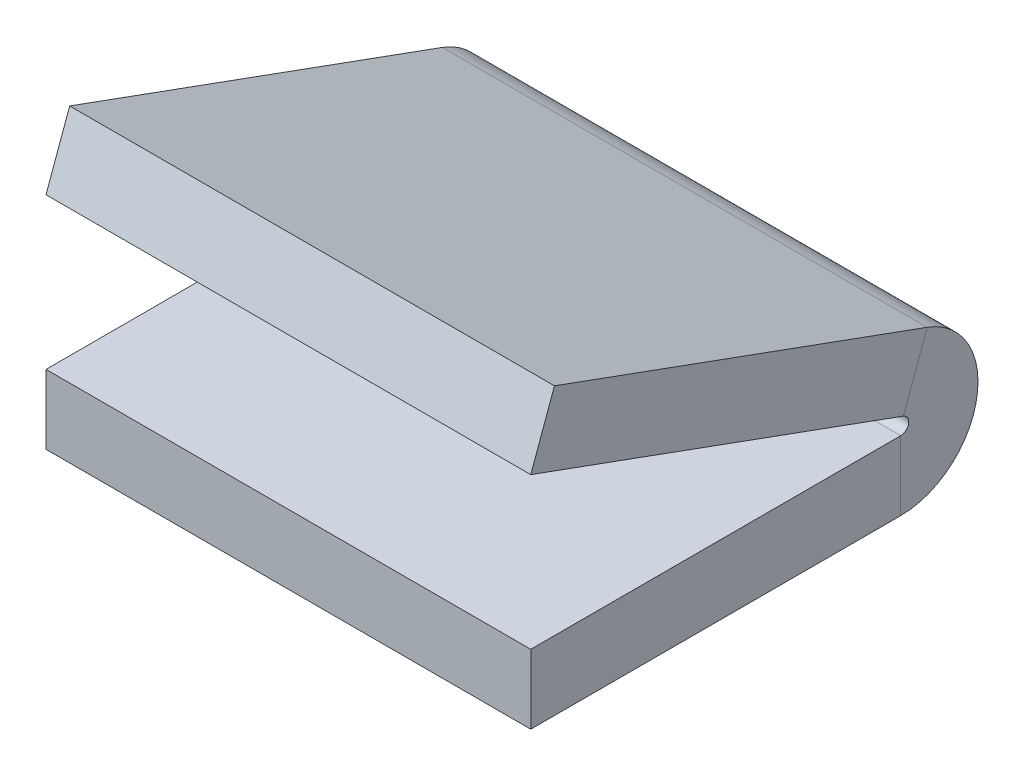
ISO-10303-21;
HEADER;
FILE_DESCRIPTION(('STEP AP214'),'2;1');
FILE_NAME('part.step','',(''),(''),'','','');
FILE_SCHEMA(('AUTOMOTIVE_DESIGN { 1 0 10303 214 1 1 1 1 }'));
ENDSEC;
DATA;
#1=APPLICATION_CONTEXT('core data for automotive mechanical design processes');
#2=APPLICATION_PROTOCOL_DEFINITION('international standard','automotive_design',2000,#1);
#3=PRODUCT_CONTEXT('',#1,'mechanical');
#4=PRODUCT('Part','Part','',(#3));
#5=PRODUCT_RELATED_PRODUCT_CATEGORY('part','',(#4));
#6=PRODUCT_DEFINITION_FORMATION('','',#4);
#7=PRODUCT_DEFINITION_CONTEXT('part definition',#1,'design');
#8=PRODUCT_DEFINITION('design','',#6,#7);
#9=PRODUCT_DEFINITION_SHAPE('','',#8);
#10=(LENGTH_UNIT() NAMED_UNIT(*) SI_UNIT(.MILLI.,.METRE.));
#11=(NAMED_UNIT(*) PLANE_ANGLE_UNIT() SI_UNIT($,.RADIAN.));
#12=(NAMED_UNIT(*) SI_UNIT($,.STERADIAN.) SOLID_ANGLE_UNIT());
#13=UNCERTAINTY_MEASURE_WITH_UNIT(LENGTH_MEASURE(1.E-05),#10,'distance_accuracy_value','');
#14=(GEOMETRIC_REPRESENTATION_CONTEXT(3) GLOBAL_UNCERTAINTY_ASSIGNED_CONTEXT((#13)) GLOBAL_UNIT_ASSIGNED_CONTEXT((#10,
#11,#12)) REPRESENTATION_CONTEXT('',''));
#15=CARTESIAN_POINT('',(0.,0.,0.));
#16=DIRECTION('',(0.,0.,1.));
#17=DIRECTION('',(1.,0.,0.));
#18=AXIS2_PLACEMENT_3D('',#15,#16,#17);
#19=CARTESIAN_POINT('',(44.45,1.42877758447095,-34.1744658492431));
#20=DIRECTION('',(1.,0.,0.));
#21=DIRECTION('',(0.,0.,-1.));
#22=AXIS2_PLACEMENT_3D('',#19,#20,#21);
#23=PLANE('',#22);
#24=DIRECTION('',(0.,0.93969262078591,-0.342020143325663));
#25=VECTOR('',#24,1.);
#26=CARTESIAN_POINT('',(44.45,1.42877758447095,-34.1744658492431));
#27=LINE('',#26,#25);
#28=CARTESIAN_POINT('',(44.45,1.42877758447095,-34.1744658492431));
#29=VERTEX_POINT('',#28);
#30=CARTESIAN_POINT('',(44.45,7.39582572646148,-36.346293759361));
#31=VERTEX_POINT('',#30);
#32=EDGE_CURVE('E11',#29,#31,#27,.T.);
#33=ORIENTED_EDGE('',*,*,#32,.F.);
#34=CARTESIAN_POINT('',(44.45,0.736600000000024,-33.9225338116694));
#35=DIRECTION('',(-1.,0.,0.));
#36=DIRECTION('',(0.,0.,1.));
#37=AXIS2_PLACEMENT_3D('',#34,#35,#36);
#38=CIRCLE('',#37,0.7366);
#39=CARTESIAN_POINT('',(44.45,0.,-33.9225338116694));
#40=VERTEX_POINT('',#39);
#41=EDGE_CURVE('E134',#40,#29,#38,.F.);
#42=ORIENTED_EDGE('',*,*,#41,.F.);
#43=DIRECTION('',(0.,1.,0.));
#44=VECTOR('',#43,1.);
#45=CARTESIAN_POINT('',(44.45,-6.34999999999998,-33.9225338116691));
#46=LINE('',#45,#44);
#47=CARTESIAN_POINT('',(44.45,-6.34999999999998,-33.9225338116691));
#48=VERTEX_POINT('',#47);
#49=EDGE_CURVE('E45',#48,#40,#46,.T.);
#50=ORIENTED_EDGE('',*,*,#49,.F.);
#51=CARTESIAN_POINT('',(44.45,0.736600000000024,-33.9225338116694));
#52=DIRECTION('',(1.,0.,0.));
#53=DIRECTION('',(0.,0.,-1.));
#54=AXIS2_PLACEMENT_3D('',#51,#52,#53);
#55=CIRCLE('',#54,7.0866);
#56=EDGE_CURVE('E127',#48,#31,#55,.T.);
#57=ORIENTED_EDGE('',*,*,#56,.T.);
#58=EDGE_LOOP('',(#33,#42,#50,#57));
#59=FACE_BOUND('',#58,.T.);
#60=ADVANCED_FACE('F37',(#59),#23,.T.);
#61=CARTESIAN_POINT('',(44.45,-6.34999999999998,-33.9225338116691));
#62=DIRECTION('',(1.,0.,0.));
#63=DIRECTION('',(0.,0.,-1.));
#64=AXIS2_PLACEMENT_3D('',#61,#62,#63);
#65=PLANE('',#64);
#66=DIRECTION('',(0.,0.342020143325663,0.939692620785911));
#67=VECTOR('',#66,1.);
#68=CARTESIAN_POINT('',(44.45,0.,-38.1));
#69=LINE('',#68,#67);
#70=CARTESIAN_POINT('',(44.45,13.867265925542,0.));
#71=VERTEX_POINT('',#70);
#72=EDGE_CURVE('E183',#29,#71,#69,.T.);
#73=ORIENTED_EDGE('',*,*,#72,.F.);
#74=ORIENTED_EDGE('',*,*,#32,.T.);
#75=DIRECTION('',(0.,0.342020143325663,0.939692620785911));
#76=VECTOR('',#75,1.);
#77=CARTESIAN_POINT('',(44.45,5.96704814199053,-40.271827910118));
#78=LINE('',#77,#76);
#79=CARTESIAN_POINT('',(44.45,19.8343140675326,-2.17182791011795));
#80=VERTEX_POINT('',#79);
#81=EDGE_CURVE('E93',#31,#80,#78,.T.);
#82=ORIENTED_EDGE('',*,*,#81,.T.);
#83=DIRECTION('',(0.,0.939692620785911,-0.342020143325661));
#84=VECTOR('',#83,1.);
#85=CARTESIAN_POINT('',(44.45,13.867265925542,0.));
#86=LINE('',#85,#84);
#87=EDGE_CURVE('E340',#71,#80,#86,.T.);
#88=ORIENTED_EDGE('',*,*,#87,.F.);
#89=EDGE_LOOP('',(#73,#74,#82,#88));
#90=FACE_BOUND('',#89,.T.);
#91=ADVANCED_FACE('F191',(#90),#65,.T.);
#92=CARTESIAN_POINT('',(0.,0.,-33.9225338116694));
#93=DIRECTION('',(-1.,0.,0.));
#94=DIRECTION('',(0.,0.,1.));
#95=AXIS2_PLACEMENT_3D('',#92,#93,#94);
#96=PLANE('',#95);
#97=DIRECTION('',(0.,-1.,0.));
#98=VECTOR('',#97,1.);
#99=CARTESIAN_POINT('',(0.,0.,-33.9225338116694));
#100=LINE('',#99,#98);
#101=CARTESIAN_POINT('',(0.,0.,-33.9225338116694));
#102=VERTEX_POINT('',#101);
#103=CARTESIAN_POINT('',(0.,-6.34999999999998,-33.9225338116691));
#104=VERTEX_POINT('',#103);
#105=EDGE_CURVE('E80',#102,#104,#100,.T.);
#106=ORIENTED_EDGE('',*,*,#105,.F.);
#107=CARTESIAN_POINT('',(0.,0.736600000000024,-33.9225338116694));
#108=DIRECTION('',(-1.,0.,0.));
#109=DIRECTION('',(0.,0.,1.));
#110=AXIS2_PLACEMENT_3D('',#107,#108,#109);
#111=CIRCLE('',#110,0.7366);
#112=CARTESIAN_POINT('',(0.,1.42877758447095,-34.1744658492431));
#113=VERTEX_POINT('',#112);
#114=EDGE_CURVE('E149',#102,#113,#111,.F.);
#115=ORIENTED_EDGE('',*,*,#114,.T.);
#116=DIRECTION('',(0.,-0.93969262078591,0.342020143325663));
#117=VECTOR('',#116,1.);
#118=CARTESIAN_POINT('',(0.,7.39582572646148,-36.346293759361));
#119=LINE('',#118,#117);
#120=CARTESIAN_POINT('',(0.,7.39582572646148,-36.346293759361));
#121=VERTEX_POINT('',#120);
#122=EDGE_CURVE('E87',#121,#113,#119,.T.);
#123=ORIENTED_EDGE('',*,*,#122,.F.);
#124=CARTESIAN_POINT('',(0.,0.736600000000024,-33.9225338116694));
#125=DIRECTION('',(1.,0.,0.));
#126=DIRECTION('',(0.,0.,-1.));
#127=AXIS2_PLACEMENT_3D('',#124,#125,#126);
#128=CIRCLE('',#127,7.0866);
#129=EDGE_CURVE('E156',#104,#121,#128,.T.);
#130=ORIENTED_EDGE('',*,*,#129,.F.);
#131=EDGE_LOOP('',(#106,#115,#123,#130));
#132=FACE_BOUND('',#131,.T.);
#133=ADVANCED_FACE('F189',(#132),#96,.T.);
#134=CARTESIAN_POINT('',(0.,7.39582572646148,-36.346293759361));
#135=DIRECTION('',(-1.,0.,0.));
#136=DIRECTION('',(0.,0.,1.));
#137=AXIS2_PLACEMENT_3D('',#134,#135,#136);
#138=PLANE('',#137);
#139=DIRECTION('',(0.,0.,-1.));
#140=VECTOR('',#139,1.);
#141=CARTESIAN_POINT('',(0.,0.,0.));
#142=LINE('',#141,#140);
#143=CARTESIAN_POINT('',(0.,0.,0.));
#144=VERTEX_POINT('',#143);
#145=EDGE_CURVE('E151',#144,#102,#142,.T.);
#146=ORIENTED_EDGE('',*,*,#145,.T.);
#147=ORIENTED_EDGE('',*,*,#105,.T.);
#148=DIRECTION('',(0.,0.,-1.));
#149=VECTOR('',#148,1.);
#150=CARTESIAN_POINT('',(0.,-6.35,0.));
#151=LINE('',#150,#149);
#152=CARTESIAN_POINT('',(0.,-6.35,0.));
#153=VERTEX_POINT('',#152);
#154=EDGE_CURVE('E154',#153,#104,#151,.T.);
#155=ORIENTED_EDGE('',*,*,#154,.F.);
#156=DIRECTION('',(0.,1.,0.));
#157=VECTOR('',#156,1.);
#158=CARTESIAN_POINT('',(0.,-6.35,0.));
#159=LINE('',#158,#157);
#160=EDGE_CURVE('E115',#153,#144,#159,.T.);
#161=ORIENTED_EDGE('',*,*,#160,.T.);
#162=EDGE_LOOP('',(#146,#147,#155,#161));
#163=FACE_BOUND('',#162,.T.);
#164=ADVANCED_FACE('F185',(#163),#138,.T.);
#165=CARTESIAN_POINT('',(44.45,5.96704814199053,-40.271827910118));
#166=DIRECTION('',(0.,-0.93969262078591,0.342020143325663));
#167=DIRECTION('',(0.,-0.342020143325663,-0.939692620785911));
#168=AXIS2_PLACEMENT_3D('',#165,#166,#167);
#169=PLANE('',#168);
#170=DIRECTION('',(0.,0.342020143325663,0.939692620785911));
#171=VECTOR('',#170,1.);
#172=CARTESIAN_POINT('',(0.,5.96704814199053,-40.271827910118));
#173=LINE('',#172,#171);
#174=CARTESIAN_POINT('',(0.,19.8343140675326,-2.17182791011795));
#175=VERTEX_POINT('',#174);
#176=EDGE_CURVE('E140',#121,#175,#173,.T.);
#177=ORIENTED_EDGE('',*,*,#176,.T.);
#178=DIRECTION('',(-1.,0.,0.));
#179=VECTOR('',#178,1.);
#180=CARTESIAN_POINT('',(44.45,19.8343140675326,-2.17182791011795));
#181=LINE('',#180,#179);
#182=EDGE_CURVE('E170',#80,#175,#181,.T.);
#183=ORIENTED_EDGE('',*,*,#182,.F.);
#184=ORIENTED_EDGE('',*,*,#81,.F.);
#185=DIRECTION('',(-1.,0.,0.));
#186=VECTOR('',#185,1.);
#187=CARTESIAN_POINT('',(44.45,7.39582572646148,-36.346293759361));
#188=LINE('',#187,#186);
#189=EDGE_CURVE('E139',#31,#121,#188,.T.);
#190=ORIENTED_EDGE('',*,*,#189,.T.);
#191=EDGE_LOOP('',(#177,#183,#184,#190));
#192=FACE_BOUND('',#191,.T.);
#193=ADVANCED_FACE('F197',(#192),#169,.F.);
#194=CARTESIAN_POINT('',(44.45,13.867265925542,0.));
#195=DIRECTION('',(0.,0.342020143325661,0.939692620785911));
#196=DIRECTION('',(0.,-0.939692620785911,0.342020143325661));
#197=AXIS2_PLACEMENT_3D('',#194,#195,#196);
#198=PLANE('',#197);
#199=DIRECTION('',(0.,0.939692620785911,-0.342020143325661));
#200=VECTOR('',#199,1.);
#201=CARTESIAN_POINT('',(0.,13.867265925542,0.));
#202=LINE('',#201,#200);
#203=CARTESIAN_POINT('',(0.,13.867265925542,0.));
#204=VERTEX_POINT('',#203);
#205=EDGE_CURVE('E143',#204,#175,#202,.T.);
#206=ORIENTED_EDGE('',*,*,#205,.F.);
#207=DIRECTION('',(-1.,0.,0.));
#208=VECTOR('',#207,1.);
#209=CARTESIAN_POINT('',(44.45,13.867265925542,0.));
#210=LINE('',#209,#208);
#211=EDGE_CURVE('E168',#71,#204,#210,.T.);
#212=ORIENTED_EDGE('',*,*,#211,.F.);
#213=ORIENTED_EDGE('',*,*,#87,.T.);
#214=ORIENTED_EDGE('',*,*,#182,.T.);
#215=EDGE_LOOP('',(#206,#212,#213,#214));
#216=FACE_BOUND('',#215,.T.);
#217=ADVANCED_FACE('F228',(#216),#198,.T.);
#218=CARTESIAN_POINT('',(44.45,0.,-38.1));
#219=DIRECTION('',(0.,-0.939692620785911,0.342020143325663));
#220=DIRECTION('',(0.,-0.342020143325663,-0.939692620785911));
#221=AXIS2_PLACEMENT_3D('',#218,#219,#220);
#222=PLANE('',#221);
#223=DIRECTION('',(0.,0.342020143325663,0.939692620785911));
#224=VECTOR('',#223,1.);
#225=CARTESIAN_POINT('',(0.,0.,-38.1));
#226=LINE('',#225,#224);
#227=EDGE_CURVE('E146',#113,#204,#226,.T.);
#228=ORIENTED_EDGE('',*,*,#227,.F.);
#229=DIRECTION('',(-1.,0.,0.));
#230=VECTOR('',#229,1.);
#231=CARTESIAN_POINT('',(44.45,1.42877758447095,-34.1744658492431));
#232=LINE('',#231,#230);
#233=EDGE_CURVE('E165',#29,#113,#232,.T.);
#234=ORIENTED_EDGE('',*,*,#233,.F.);
#235=ORIENTED_EDGE('',*,*,#72,.T.);
#236=ORIENTED_EDGE('',*,*,#211,.T.);
#237=EDGE_LOOP('',(#228,#234,#235,#236));
#238=FACE_BOUND('',#237,.T.);
#239=ADVANCED_FACE('F239',(#238),#222,.T.);
#240=CARTESIAN_POINT('',(44.45,0.736600000000024,-33.9225338116694));
#241=DIRECTION('',(-1.,0.,0.));
#242=DIRECTION('',(0.,0.,1.));
#243=AXIS2_PLACEMENT_3D('',#240,#241,#242);
#244=CYLINDRICAL_SURFACE('',#243,0.7366);
#245=ORIENTED_EDGE('',*,*,#114,.F.);
#246=DIRECTION('',(-1.,0.,0.));
#247=VECTOR('',#246,1.);
#248=CARTESIAN_POINT('',(44.45,0.,-33.9225338116694));
#249=LINE('',#248,#247);
#250=EDGE_CURVE('E162',#40,#102,#249,.T.);
#251=ORIENTED_EDGE('',*,*,#250,.F.);
#252=ORIENTED_EDGE('',*,*,#41,.T.);
#253=ORIENTED_EDGE('',*,*,#233,.T.);
#254=EDGE_LOOP('',(#245,#251,#252,#253));
#255=FACE_BOUND('',#254,.T.);
#256=ADVANCED_FACE('F179',(#255),#244,.F.);
#257=CARTESIAN_POINT('',(44.45,0.,0.));
#258=DIRECTION('',(0.,1.,0.));
#259=DIRECTION('',(0.,0.,1.));
#260=AXIS2_PLACEMENT_3D('',#257,#258,#259);
#261=PLANE('',#260);
#262=ORIENTED_EDGE('',*,*,#145,.F.);
#263=DIRECTION('',(-1.,0.,0.));
#264=VECTOR('',#263,1.);
#265=CARTESIAN_POINT('',(44.45,0.,0.));
#266=LINE('',#265,#264);
#267=CARTESIAN_POINT('',(44.45,0.,0.));
#268=VERTEX_POINT('',#267);
#269=EDGE_CURVE('E117',#268,#144,#266,.T.);
#270=ORIENTED_EDGE('',*,*,#269,.F.);
#271=DIRECTION('',(0.,0.,-1.));
#272=VECTOR('',#271,1.);
#273=CARTESIAN_POINT('',(44.45,0.,0.));
#274=LINE('',#273,#272);
#275=EDGE_CURVE('E132',#268,#40,#274,.T.);
#276=ORIENTED_EDGE('',*,*,#275,.T.);
#277=ORIENTED_EDGE('',*,*,#250,.T.);
#278=EDGE_LOOP('',(#262,#270,#276,#277));
#279=FACE_BOUND('',#278,.T.);
#280=ADVANCED_FACE('F184',(#279),#261,.T.);
#281=CARTESIAN_POINT('',(44.45,-6.35,0.));
#282=DIRECTION('',(0.,0.,1.));
#283=DIRECTION('',(1.,0.,0.));
#284=AXIS2_PLACEMENT_3D('',#281,#282,#283);
#285=PLANE('',#284);
#286=ORIENTED_EDGE('',*,*,#160,.F.);
#287=DIRECTION('',(-1.,0.,0.));
#288=VECTOR('',#287,1.);
#289=CARTESIAN_POINT('',(44.45,-6.35,0.));
#290=LINE('',#289,#288);
#291=CARTESIAN_POINT('',(44.45,-6.35,0.));
#292=VERTEX_POINT('',#291);
#293=EDGE_CURVE('E109',#292,#153,#290,.T.);
#294=ORIENTED_EDGE('',*,*,#293,.F.);
#295=DIRECTION('',(0.,1.,0.));
#296=VECTOR('',#295,1.);
#297=CARTESIAN_POINT('',(44.45,-6.35,0.));
#298=LINE('',#297,#296);
#299=EDGE_CURVE('E113',#292,#268,#298,.T.);
#300=ORIENTED_EDGE('',*,*,#299,.T.);
#301=ORIENTED_EDGE('',*,*,#269,.T.);
#302=EDGE_LOOP('',(#286,#294,#300,#301));
#303=FACE_BOUND('',#302,.T.);
#304=ADVANCED_FACE('F111',(#303),#285,.T.);
#305=CARTESIAN_POINT('',(44.45,-6.35,0.));
#306=DIRECTION('',(0.,1.,0.));
#307=DIRECTION('',(0.,0.,1.));
#308=AXIS2_PLACEMENT_3D('',#305,#306,#307);
#309=PLANE('',#308);
#310=ORIENTED_EDGE('',*,*,#154,.T.);
#311=DIRECTION('',(-1.,0.,0.));
#312=VECTOR('',#311,1.);
#313=CARTESIAN_POINT('',(44.45,-6.34999999999998,-33.9225338116691));
#314=LINE('',#313,#312);
#315=EDGE_CURVE('E118',#48,#104,#314,.T.);
#316=ORIENTED_EDGE('',*,*,#315,.F.);
#317=DIRECTION('',(0.,0.,-1.));
#318=VECTOR('',#317,1.);
#319=CARTESIAN_POINT('',(44.45,-6.35,0.));
#320=LINE('',#319,#318);
#321=EDGE_CURVE('E122',#292,#48,#320,.T.);
#322=ORIENTED_EDGE('',*,*,#321,.F.);
#323=ORIENTED_EDGE('',*,*,#293,.T.);
#324=EDGE_LOOP('',(#310,#316,#322,#323));
#325=FACE_BOUND('',#324,.T.);
#326=ADVANCED_FACE('F123',(#325),#309,.F.);
#327=CARTESIAN_POINT('',(44.45,0.736600000000024,-33.9225338116694));
#328=DIRECTION('',(-1.,0.,0.));
#329=DIRECTION('',(0.,0.,1.));
#330=AXIS2_PLACEMENT_3D('',#327,#328,#329);
#331=CYLINDRICAL_SURFACE('',#330,7.0866);
#332=ORIENTED_EDGE('',*,*,#129,.T.);
#333=ORIENTED_EDGE('',*,*,#189,.F.);
#334=ORIENTED_EDGE('',*,*,#56,.F.);
#335=ORIENTED_EDGE('',*,*,#315,.T.);
#336=EDGE_LOOP('',(#332,#333,#334,#335));
#337=FACE_BOUND('',#336,.T.);
#338=ADVANCED_FACE('F187',(#337),#331,.T.);
#339=CARTESIAN_POINT('',(44.45,0.736600000000024,-33.9225338116694));
#340=DIRECTION('',(-1.,0.,0.));
#341=DIRECTION('',(0.,0.,1.));
#342=AXIS2_PLACEMENT_3D('',#339,#340,#341);
#343=PLANE('',#342);
#344=ORIENTED_EDGE('',*,*,#321,.T.);
#345=ORIENTED_EDGE('',*,*,#49,.T.);
#346=ORIENTED_EDGE('',*,*,#275,.F.);
#347=ORIENTED_EDGE('',*,*,#299,.F.);
#348=EDGE_LOOP('',(#344,#345,#346,#347));
#349=FACE_BOUND('',#348,.T.);
#350=ADVANCED_FACE('F130',(#349),#343,.F.);
#351=CARTESIAN_POINT('',(0.,0.736600000000024,-33.9225338116694));
#352=DIRECTION('',(-1.,0.,0.));
#353=DIRECTION('',(0.,0.,1.));
#354=AXIS2_PLACEMENT_3D('',#351,#352,#353);
#355=PLANE('',#354);
#356=ORIENTED_EDGE('',*,*,#176,.F.);
#357=ORIENTED_EDGE('',*,*,#122,.T.);
#358=ORIENTED_EDGE('',*,*,#227,.T.);
#359=ORIENTED_EDGE('',*,*,#205,.T.);
#360=EDGE_LOOP('',(#356,#357,#358,#359));
#361=FACE_BOUND('',#360,.T.);
#362=ADVANCED_FACE('F305',(#361),#355,.T.);
#363=CLOSED_SHELL('',(#60,#91,#133,#164,#193,#217,#239,#256,#280,#304,#326,#338,#350,#362));
#364=MANIFOLD_SOLID_BREP('B2',#363);
#365=ADVANCED_BREP_SHAPE_REPRESENTATION('',(#18,#364),#14);
#366=SHAPE_DEFINITION_REPRESENTATION(#9,#365);
ENDSEC;
END-ISO-10303-21;
